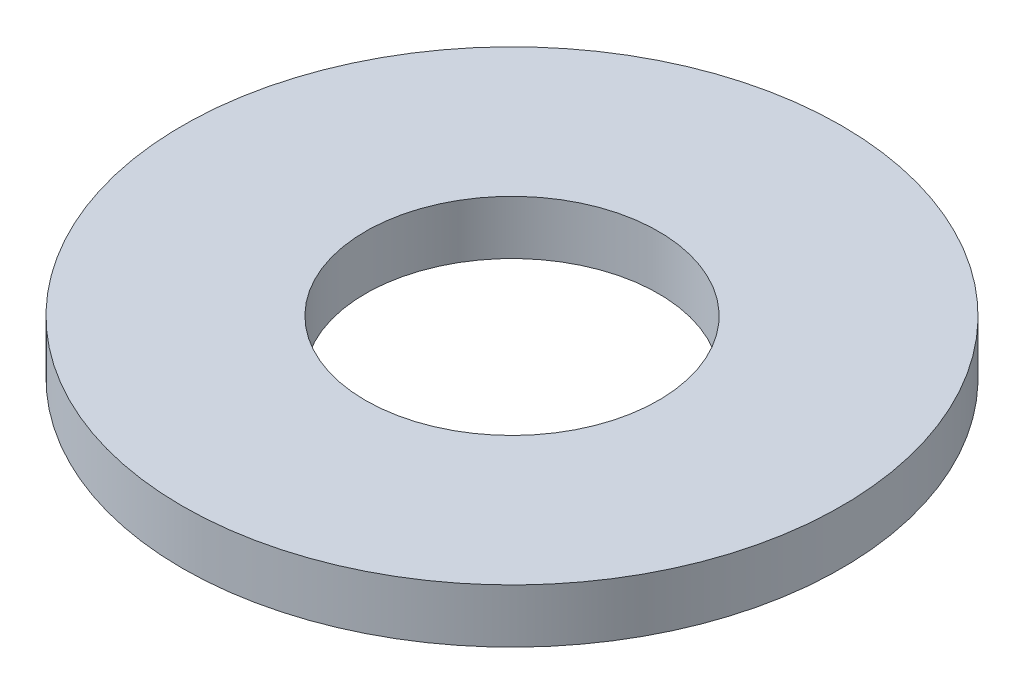
ISO-10303-21;
HEADER;
FILE_DESCRIPTION(('STEP AP214'),'2;1');
FILE_NAME('part.step','',(''),(''),'','','');
FILE_SCHEMA(('AUTOMOTIVE_DESIGN { 1 0 10303 214 1 1 1 1 }'));
ENDSEC;
DATA;
#1=APPLICATION_CONTEXT('core data for automotive mechanical design processes');
#2=APPLICATION_PROTOCOL_DEFINITION('international standard','automotive_design',2000,#1);
#3=PRODUCT_CONTEXT('',#1,'mechanical');
#4=PRODUCT('Part','Part','',(#3));
#5=PRODUCT_RELATED_PRODUCT_CATEGORY('part','',(#4));
#6=PRODUCT_DEFINITION_FORMATION('','',#4);
#7=PRODUCT_DEFINITION_CONTEXT('part definition',#1,'design');
#8=PRODUCT_DEFINITION('design','',#6,#7);
#9=PRODUCT_DEFINITION_SHAPE('','',#8);
#10=(LENGTH_UNIT() NAMED_UNIT(*) SI_UNIT(.MILLI.,.METRE.));
#11=(NAMED_UNIT(*) PLANE_ANGLE_UNIT() SI_UNIT($,.RADIAN.));
#12=(NAMED_UNIT(*) SI_UNIT($,.STERADIAN.) SOLID_ANGLE_UNIT());
#13=UNCERTAINTY_MEASURE_WITH_UNIT(LENGTH_MEASURE(1.E-05),#10,'distance_accuracy_value','');
#14=(GEOMETRIC_REPRESENTATION_CONTEXT(3) GLOBAL_UNCERTAINTY_ASSIGNED_CONTEXT((#13)) GLOBAL_UNIT_ASSIGNED_CONTEXT((#10,
#11,#12)) REPRESENTATION_CONTEXT('',''));
#15=CARTESIAN_POINT('',(0.,0.,0.));
#16=DIRECTION('',(0.,0.,1.));
#17=DIRECTION('',(1.,0.,0.));
#18=AXIS2_PLACEMENT_3D('',#15,#16,#17);
#19=CARTESIAN_POINT('',(0.,2.3368,0.));
#20=DIRECTION('',(0.,1.,0.));
#21=DIRECTION('',(0.,0.,1.));
#22=AXIS2_PLACEMENT_3D('',#19,#20,#21);
#23=PLANE('',#22);
#24=CARTESIAN_POINT('',(0.,2.3368,0.));
#25=DIRECTION('',(0.,1.,0.));
#26=DIRECTION('',(0.,0.,1.));
#27=AXIS2_PLACEMENT_3D('',#24,#25,#26);
#28=CIRCLE('',#27,14.2875);
#29=CARTESIAN_POINT('',(0.,2.3368,14.2875));
#30=VERTEX_POINT('',#29);
#31=EDGE_CURVE('E10',#30,#30,#28,.T.);
#32=ORIENTED_EDGE('',*,*,#31,.T.);
#33=EDGE_LOOP('',(#32));
#34=FACE_BOUND('',#33,.T.);
#35=CARTESIAN_POINT('',(0.,2.3368,0.));
#36=DIRECTION('',(0.,1.,0.));
#37=DIRECTION('',(0.,0.,1.));
#38=AXIS2_PLACEMENT_3D('',#35,#36,#37);
#39=CIRCLE('',#38,6.35);
#40=CARTESIAN_POINT('',(0.,2.3368,6.35));
#41=VERTEX_POINT('',#40);
#42=EDGE_CURVE('E44',#41,#41,#39,.T.);
#43=ORIENTED_EDGE('',*,*,#42,.F.);
#44=EDGE_LOOP('',(#43));
#45=FACE_BOUND('',#44,.T.);
#46=ADVANCED_FACE('F33',(#34,#45),#23,.T.);
#47=CARTESIAN_POINT('',(0.,0.,0.));
#48=DIRECTION('',(0.,1.,0.));
#49=DIRECTION('',(0.,0.,1.));
#50=AXIS2_PLACEMENT_3D('',#47,#48,#49);
#51=PLANE('',#50);
#52=CARTESIAN_POINT('',(0.,0.,0.));
#53=DIRECTION('',(0.,1.,0.));
#54=DIRECTION('',(0.,0.,1.));
#55=AXIS2_PLACEMENT_3D('',#52,#53,#54);
#56=CIRCLE('',#55,14.2875);
#57=CARTESIAN_POINT('',(0.,0.,14.2875));
#58=VERTEX_POINT('',#57);
#59=EDGE_CURVE('E37',#58,#58,#56,.T.);
#60=ORIENTED_EDGE('',*,*,#59,.F.);
#61=EDGE_LOOP('',(#60));
#62=FACE_BOUND('',#61,.T.);
#63=CARTESIAN_POINT('',(0.,0.,0.));
#64=DIRECTION('',(0.,1.,0.));
#65=DIRECTION('',(0.,0.,1.));
#66=AXIS2_PLACEMENT_3D('',#63,#64,#65);
#67=CIRCLE('',#66,6.35);
#68=CARTESIAN_POINT('',(0.,0.,6.35));
#69=VERTEX_POINT('',#68);
#70=EDGE_CURVE('E46',#69,#69,#67,.T.);
#71=ORIENTED_EDGE('',*,*,#70,.T.);
#72=EDGE_LOOP('',(#71));
#73=FACE_BOUND('',#72,.T.);
#74=ADVANCED_FACE('F56',(#62,#73),#51,.F.);
#75=CARTESIAN_POINT('',(0.,2.3368,0.));
#76=DIRECTION('',(0.,-1.,0.));
#77=DIRECTION('',(0.,0.,-1.));
#78=AXIS2_PLACEMENT_3D('',#75,#76,#77);
#79=CYLINDRICAL_SURFACE('',#78,14.2875);
#80=ORIENTED_EDGE('',*,*,#31,.F.);
#81=EDGE_LOOP('',(#80));
#82=FACE_BOUND('',#81,.T.);
#83=ORIENTED_EDGE('',*,*,#59,.T.);
#84=EDGE_LOOP('',(#83));
#85=FACE_BOUND('',#84,.T.);
#86=ADVANCED_FACE('F35',(#82,#85),#79,.T.);
#87=CARTESIAN_POINT('',(0.,2.3368,0.));
#88=DIRECTION('',(0.,-1.,0.));
#89=DIRECTION('',(0.,0.,-1.));
#90=AXIS2_PLACEMENT_3D('',#87,#88,#89);
#91=CYLINDRICAL_SURFACE('',#90,6.35);
#92=ORIENTED_EDGE('',*,*,#42,.T.);
#93=EDGE_LOOP('',(#92));
#94=FACE_BOUND('',#93,.T.);
#95=ORIENTED_EDGE('',*,*,#70,.F.);
#96=EDGE_LOOP('',(#95));
#97=FACE_BOUND('',#96,.T.);
#98=ADVANCED_FACE('F52',(#94,#97),#91,.F.);
#99=CLOSED_SHELL('',(#46,#74,#86,#98));
#100=MANIFOLD_SOLID_BREP('B2',#99);
#101=ADVANCED_BREP_SHAPE_REPRESENTATION('',(#18,#100),#14);
#102=SHAPE_DEFINITION_REPRESENTATION(#9,#101);
ENDSEC;
END-ISO-10303-21;
